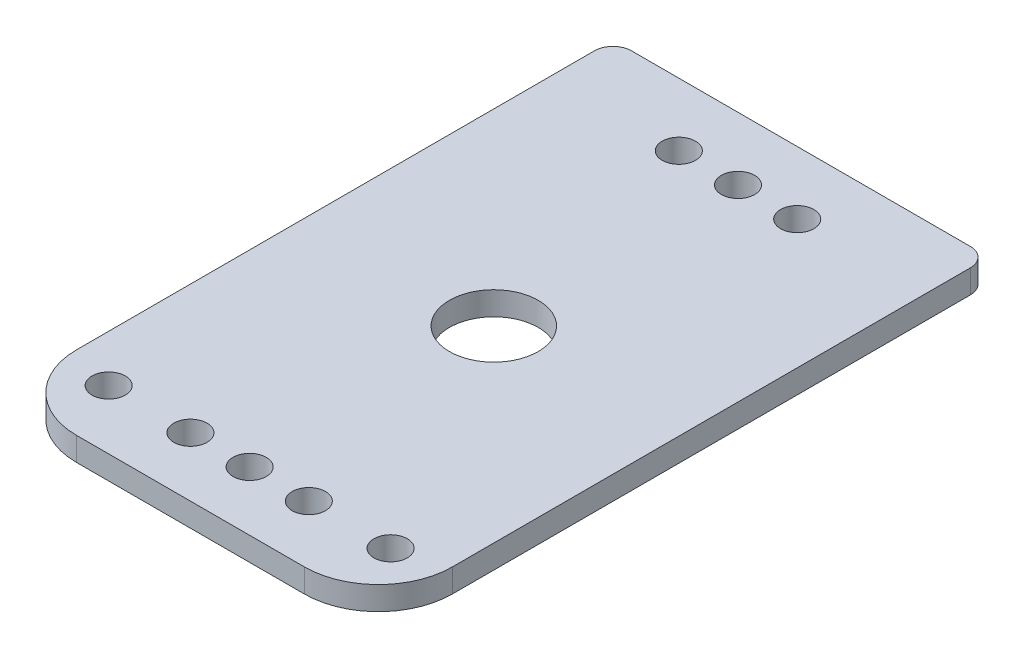
ISO-10303-21;
HEADER;
FILE_DESCRIPTION(('STEP AP214'),'2;1');
FILE_NAME('part.step','',(''),(''),'','','');
FILE_SCHEMA(('AUTOMOTIVE_DESIGN { 1 0 10303 214 1 1 1 1 }'));
ENDSEC;
DATA;
#1=APPLICATION_CONTEXT('core data for automotive mechanical design processes');
#2=APPLICATION_PROTOCOL_DEFINITION('international standard','automotive_design',2000,#1);
#3=PRODUCT_CONTEXT('',#1,'mechanical');
#4=PRODUCT('Part','Part','',(#3));
#5=PRODUCT_RELATED_PRODUCT_CATEGORY('part','',(#4));
#6=PRODUCT_DEFINITION_FORMATION('','',#4);
#7=PRODUCT_DEFINITION_CONTEXT('part definition',#1,'design');
#8=PRODUCT_DEFINITION('design','',#6,#7);
#9=PRODUCT_DEFINITION_SHAPE('','',#8);
#10=(LENGTH_UNIT() NAMED_UNIT(*) SI_UNIT(.MILLI.,.METRE.));
#11=(NAMED_UNIT(*) PLANE_ANGLE_UNIT() SI_UNIT($,.RADIAN.));
#12=(NAMED_UNIT(*) SI_UNIT($,.STERADIAN.) SOLID_ANGLE_UNIT());
#13=UNCERTAINTY_MEASURE_WITH_UNIT(LENGTH_MEASURE(1.E-05),#10,'distance_accuracy_value','');
#14=(GEOMETRIC_REPRESENTATION_CONTEXT(3) GLOBAL_UNCERTAINTY_ASSIGNED_CONTEXT((#13)) GLOBAL_UNIT_ASSIGNED_CONTEXT((#10,
#11,#12)) REPRESENTATION_CONTEXT('',''));
#15=CARTESIAN_POINT('',(0.,0.,0.));
#16=DIRECTION('',(0.,0.,1.));
#17=DIRECTION('',(1.,0.,0.));
#18=AXIS2_PLACEMENT_3D('',#15,#16,#17);
#19=CARTESIAN_POINT('',(22.9,121.175,-39.));
#20=DIRECTION('',(0.,1.,0.));
#21=DIRECTION('',(0.,0.,1.));
#22=AXIS2_PLACEMENT_3D('',#19,#20,#21);
#23=PLANE('',#22);
#24=CARTESIAN_POINT('',(8.,121.175,33.));
#25=DIRECTION('',(0.,1.,0.));
#26=DIRECTION('',(0.,0.,1.));
#27=AXIS2_PLACEMENT_3D('',#24,#25,#26);
#28=CIRCLE('',#27,2.25000000000021);
#29=CARTESIAN_POINT('',(8.,121.175,35.2500000000002));
#30=VERTEX_POINT('',#29);
#31=EDGE_CURVE('E224',#30,#30,#28,.T.);
#32=ORIENTED_EDGE('',*,*,#31,.F.);
#33=EDGE_LOOP('',(#32));
#34=FACE_BOUND('',#33,.T.);
#35=CARTESIAN_POINT('',(-7.99999999999975,121.175,33.));
#36=DIRECTION('',(0.,1.,0.));
#37=DIRECTION('',(0.,0.,1.));
#38=AXIS2_PLACEMENT_3D('',#35,#36,#37);
#39=CIRCLE('',#38,2.25);
#40=CARTESIAN_POINT('',(-7.99999999999975,121.175,35.25));
#41=VERTEX_POINT('',#40);
#42=EDGE_CURVE('E212',#41,#41,#39,.T.);
#43=ORIENTED_EDGE('',*,*,#42,.F.);
#44=EDGE_LOOP('',(#43));
#45=FACE_BOUND('',#44,.T.);
#46=CARTESIAN_POINT('',(-8.,121.175,-33.));
#47=DIRECTION('',(0.,1.,0.));
#48=DIRECTION('',(0.,0.,1.));
#49=AXIS2_PLACEMENT_3D('',#46,#47,#48);
#50=CIRCLE('',#49,2.25);
#51=CARTESIAN_POINT('',(-8.,121.175,-30.75));
#52=VERTEX_POINT('',#51);
#53=EDGE_CURVE('E200',#52,#52,#50,.T.);
#54=ORIENTED_EDGE('',*,*,#53,.F.);
#55=EDGE_LOOP('',(#54));
#56=FACE_BOUND('',#55,.T.);
#57=CARTESIAN_POINT('',(8.,121.175,-33.));
#58=DIRECTION('',(0.,1.,0.));
#59=DIRECTION('',(0.,0.,1.));
#60=AXIS2_PLACEMENT_3D('',#57,#58,#59);
#61=CIRCLE('',#60,2.25);
#62=CARTESIAN_POINT('',(8.,121.175,-30.75));
#63=VERTEX_POINT('',#62);
#64=EDGE_CURVE('E188',#63,#63,#61,.T.);
#65=ORIENTED_EDGE('',*,*,#64,.F.);
#66=EDGE_LOOP('',(#65));
#67=FACE_BOUND('',#66,.T.);
#68=CARTESIAN_POINT('',(22.9,121.175,-39.));
#69=DIRECTION('',(0.,1.,0.));
#70=DIRECTION('',(0.,0.,1.));
#71=AXIS2_PLACEMENT_3D('',#68,#69,#70);
#72=CIRCLE('',#71,2.5);
#73=CARTESIAN_POINT('',(25.4,121.175,-39.));
#74=VERTEX_POINT('',#73);
#75=CARTESIAN_POINT('',(22.9,121.175,-41.5));
#76=VERTEX_POINT('',#75);
#77=EDGE_CURVE('E151',#74,#76,#72,.T.);
#78=ORIENTED_EDGE('',*,*,#77,.T.);
#79=DIRECTION('',(-1.,0.,0.));
#80=VECTOR('',#79,1.);
#81=CARTESIAN_POINT('',(-22.9,121.175,-41.5));
#82=LINE('',#81,#80);
#83=CARTESIAN_POINT('',(-22.9,121.175,-41.5));
#84=VERTEX_POINT('',#83);
#85=EDGE_CURVE('E99',#76,#84,#82,.T.);
#86=ORIENTED_EDGE('',*,*,#85,.T.);
#87=CARTESIAN_POINT('',(-22.9,121.175,-39.));
#88=DIRECTION('',(0.,1.,0.));
#89=DIRECTION('',(0.,0.,1.));
#90=AXIS2_PLACEMENT_3D('',#87,#88,#89);
#91=CIRCLE('',#90,2.5);
#92=CARTESIAN_POINT('',(-25.4,121.175,-39.));
#93=VERTEX_POINT('',#92);
#94=EDGE_CURVE('E166',#84,#93,#91,.T.);
#95=ORIENTED_EDGE('',*,*,#94,.T.);
#96=DIRECTION('',(0.,0.,1.));
#97=VECTOR('',#96,1.);
#98=CARTESIAN_POINT('',(-25.4,121.175,-39.));
#99=LINE('',#98,#97);
#100=CARTESIAN_POINT('',(-25.4,121.175,30.9999999999999));
#101=VERTEX_POINT('',#100);
#102=EDGE_CURVE('E179',#93,#101,#99,.T.);
#103=ORIENTED_EDGE('',*,*,#102,.T.);
#104=CARTESIAN_POINT('',(-15.4,121.175,31.));
#105=DIRECTION('',(0.,1.,0.));
#106=DIRECTION('',(0.,0.,1.));
#107=AXIS2_PLACEMENT_3D('',#104,#105,#106);
#108=CIRCLE('',#107,10.);
#109=CARTESIAN_POINT('',(-15.3999999999999,121.175,41.));
#110=VERTEX_POINT('',#109);
#111=EDGE_CURVE('E118',#101,#110,#108,.T.);
#112=ORIENTED_EDGE('',*,*,#111,.T.);
#113=DIRECTION('',(1.,0.,0.));
#114=VECTOR('',#113,1.);
#115=CARTESIAN_POINT('',(-15.3999999999999,121.175,41.));
#116=LINE('',#115,#114);
#117=CARTESIAN_POINT('',(15.3999999999995,121.175,41.));
#118=VERTEX_POINT('',#117);
#119=EDGE_CURVE('E112',#110,#118,#116,.T.);
#120=ORIENTED_EDGE('',*,*,#119,.T.);
#121=CARTESIAN_POINT('',(15.4,121.175,31.));
#122=DIRECTION('',(0.,1.,0.));
#123=DIRECTION('',(0.,0.,1.));
#124=AXIS2_PLACEMENT_3D('',#121,#122,#123);
#125=CIRCLE('',#124,9.99999999999995);
#126=CARTESIAN_POINT('',(25.3999999999999,121.175,31.));
#127=VERTEX_POINT('',#126);
#128=EDGE_CURVE('E116',#118,#127,#125,.T.);
#129=ORIENTED_EDGE('',*,*,#128,.T.);
#130=DIRECTION('',(0.,0.,-1.));
#131=VECTOR('',#130,1.);
#132=CARTESIAN_POINT('',(25.4,121.175,-39.));
#133=LINE('',#132,#131);
#134=EDGE_CURVE('E56',#127,#74,#133,.T.);
#135=ORIENTED_EDGE('',*,*,#134,.T.);
#136=EDGE_LOOP('',(#78,#86,#95,#103,#112,#120,#129,#135));
#137=FACE_BOUND('',#136,.T.);
#138=CARTESIAN_POINT('',(0.,121.175,0.));
#139=DIRECTION('',(0.,1.,0.));
#140=DIRECTION('',(0.,0.,1.));
#141=AXIS2_PLACEMENT_3D('',#138,#139,#140);
#142=CIRCLE('',#141,5.99999999999999);
#143=CARTESIAN_POINT('',(0.,121.175,5.99999999999999));
#144=VERTEX_POINT('',#143);
#145=EDGE_CURVE('E140',#144,#144,#142,.T.);
#146=ORIENTED_EDGE('',*,*,#145,.F.);
#147=EDGE_LOOP('',(#146));
#148=FACE_BOUND('',#147,.T.);
#149=CARTESIAN_POINT('',(0.,121.175,-33.));
#150=DIRECTION('',(0.,1.,0.));
#151=DIRECTION('',(0.,0.,1.));
#152=AXIS2_PLACEMENT_3D('',#149,#150,#151);
#153=CIRCLE('',#152,2.25000000000001);
#154=CARTESIAN_POINT('',(0.,121.175,-30.75));
#155=VERTEX_POINT('',#154);
#156=EDGE_CURVE('E194',#155,#155,#153,.T.);
#157=ORIENTED_EDGE('',*,*,#156,.F.);
#158=EDGE_LOOP('',(#157));
#159=FACE_BOUND('',#158,.T.);
#160=CARTESIAN_POINT('',(-19.05,121.175,33.));
#161=DIRECTION('',(0.,1.,0.));
#162=DIRECTION('',(0.,0.,1.));
#163=AXIS2_PLACEMENT_3D('',#160,#161,#162);
#164=CIRCLE('',#163,2.25);
#165=CARTESIAN_POINT('',(-19.05,121.175,35.25));
#166=VERTEX_POINT('',#165);
#167=EDGE_CURVE('E206',#166,#166,#164,.T.);
#168=ORIENTED_EDGE('',*,*,#167,.F.);
#169=EDGE_LOOP('',(#168));
#170=FACE_BOUND('',#169,.T.);
#171=CARTESIAN_POINT('',(2.26396433926461E-13,121.175,33.));
#172=DIRECTION('',(0.,1.,0.));
#173=DIRECTION('',(0.,0.,1.));
#174=AXIS2_PLACEMENT_3D('',#171,#172,#173);
#175=CIRCLE('',#174,2.25);
#176=CARTESIAN_POINT('',(2.26396433926461E-13,121.175,35.25));
#177=VERTEX_POINT('',#176);
#178=EDGE_CURVE('E218',#177,#177,#175,.T.);
#179=ORIENTED_EDGE('',*,*,#178,.F.);
#180=EDGE_LOOP('',(#179));
#181=FACE_BOUND('',#180,.T.);
#182=CARTESIAN_POINT('',(19.05,121.175,33.));
#183=DIRECTION('',(0.,1.,0.));
#184=DIRECTION('',(0.,0.,1.));
#185=AXIS2_PLACEMENT_3D('',#182,#183,#184);
#186=CIRCLE('',#185,2.25000000000001);
#187=CARTESIAN_POINT('',(19.05,121.175,35.25));
#188=VERTEX_POINT('',#187);
#189=EDGE_CURVE('E230',#188,#188,#186,.T.);
#190=ORIENTED_EDGE('',*,*,#189,.F.);
#191=EDGE_LOOP('',(#190));
#192=FACE_BOUND('',#191,.T.);
#193=ADVANCED_FACE('F39',(#34,#45,#56,#67,#137,#148,#159,#170,#181,#192),#23,.T.);
#194=CARTESIAN_POINT('',(22.9,118.,-39.));
#195=DIRECTION('',(0.,1.,0.));
#196=DIRECTION('',(0.,0.,1.));
#197=AXIS2_PLACEMENT_3D('',#194,#195,#196);
#198=PLANE('',#197);
#199=CARTESIAN_POINT('',(22.9,118.,-39.));
#200=DIRECTION('',(0.,1.,0.));
#201=DIRECTION('',(0.,0.,1.));
#202=AXIS2_PLACEMENT_3D('',#199,#200,#201);
#203=CIRCLE('',#202,2.5);
#204=CARTESIAN_POINT('',(25.4,118.,-39.));
#205=VERTEX_POINT('',#204);
#206=CARTESIAN_POINT('',(22.9,118.,-41.5));
#207=VERTEX_POINT('',#206);
#208=EDGE_CURVE('E136',#205,#207,#203,.T.);
#209=ORIENTED_EDGE('',*,*,#208,.F.);
#210=DIRECTION('',(0.,0.,-1.));
#211=VECTOR('',#210,1.);
#212=CARTESIAN_POINT('',(25.4,118.,-39.));
#213=LINE('',#212,#211);
#214=CARTESIAN_POINT('',(25.3999999999999,118.,31.));
#215=VERTEX_POINT('',#214);
#216=EDGE_CURVE('E91',#215,#205,#213,.T.);
#217=ORIENTED_EDGE('',*,*,#216,.F.);
#218=CARTESIAN_POINT('',(15.4,118.,31.));
#219=DIRECTION('',(0.,1.,0.));
#220=DIRECTION('',(0.,0.,1.));
#221=AXIS2_PLACEMENT_3D('',#218,#219,#220);
#222=CIRCLE('',#221,9.99999999999995);
#223=CARTESIAN_POINT('',(15.3999999999995,118.,41.));
#224=VERTEX_POINT('',#223);
#225=EDGE_CURVE('E85',#224,#215,#222,.T.);
#226=ORIENTED_EDGE('',*,*,#225,.F.);
#227=DIRECTION('',(1.,0.,0.));
#228=VECTOR('',#227,1.);
#229=CARTESIAN_POINT('',(-15.3999999999999,118.,41.));
#230=LINE('',#229,#228);
#231=CARTESIAN_POINT('',(-15.3999999999999,118.,41.));
#232=VERTEX_POINT('',#231);
#233=EDGE_CURVE('E126',#232,#224,#230,.T.);
#234=ORIENTED_EDGE('',*,*,#233,.F.);
#235=CARTESIAN_POINT('',(-15.4,118.,31.));
#236=DIRECTION('',(0.,1.,0.));
#237=DIRECTION('',(0.,0.,1.));
#238=AXIS2_PLACEMENT_3D('',#235,#236,#237);
#239=CIRCLE('',#238,10.);
#240=CARTESIAN_POINT('',(-25.4,118.,30.9999999999999));
#241=VERTEX_POINT('',#240);
#242=EDGE_CURVE('E146',#241,#232,#239,.T.);
#243=ORIENTED_EDGE('',*,*,#242,.F.);
#244=DIRECTION('',(0.,0.,1.));
#245=VECTOR('',#244,1.);
#246=CARTESIAN_POINT('',(-25.4,118.,-39.));
#247=LINE('',#246,#245);
#248=CARTESIAN_POINT('',(-25.4,118.,-39.));
#249=VERTEX_POINT('',#248);
#250=EDGE_CURVE('E144',#249,#241,#247,.T.);
#251=ORIENTED_EDGE('',*,*,#250,.F.);
#252=CARTESIAN_POINT('',(-22.9,118.,-39.));
#253=DIRECTION('',(0.,1.,0.));
#254=DIRECTION('',(0.,0.,1.));
#255=AXIS2_PLACEMENT_3D('',#252,#253,#254);
#256=CIRCLE('',#255,2.5);
#257=CARTESIAN_POINT('',(-22.9,118.,-41.5));
#258=VERTEX_POINT('',#257);
#259=EDGE_CURVE('E142',#258,#249,#256,.T.);
#260=ORIENTED_EDGE('',*,*,#259,.F.);
#261=DIRECTION('',(-1.,0.,0.));
#262=VECTOR('',#261,1.);
#263=CARTESIAN_POINT('',(-22.9,118.,-41.5));
#264=LINE('',#263,#262);
#265=EDGE_CURVE('E139',#207,#258,#264,.T.);
#266=ORIENTED_EDGE('',*,*,#265,.F.);
#267=EDGE_LOOP('',(#209,#217,#226,#234,#243,#251,#260,#266));
#268=FACE_BOUND('',#267,.T.);
#269=CARTESIAN_POINT('',(0.,118.,0.));
#270=DIRECTION('',(0.,1.,0.));
#271=DIRECTION('',(0.,0.,1.));
#272=AXIS2_PLACEMENT_3D('',#269,#270,#271);
#273=CIRCLE('',#272,5.99999999999999);
#274=CARTESIAN_POINT('',(0.,118.,5.99999999999999));
#275=VERTEX_POINT('',#274);
#276=EDGE_CURVE('E185',#275,#275,#273,.T.);
#277=ORIENTED_EDGE('',*,*,#276,.T.);
#278=EDGE_LOOP('',(#277));
#279=FACE_BOUND('',#278,.T.);
#280=CARTESIAN_POINT('',(8.,118.,-33.));
#281=DIRECTION('',(0.,1.,0.));
#282=DIRECTION('',(0.,0.,1.));
#283=AXIS2_PLACEMENT_3D('',#280,#281,#282);
#284=CIRCLE('',#283,2.25);
#285=CARTESIAN_POINT('',(8.,118.,-30.75));
#286=VERTEX_POINT('',#285);
#287=EDGE_CURVE('E191',#286,#286,#284,.T.);
#288=ORIENTED_EDGE('',*,*,#287,.T.);
#289=EDGE_LOOP('',(#288));
#290=FACE_BOUND('',#289,.T.);
#291=CARTESIAN_POINT('',(0.,118.,-33.));
#292=DIRECTION('',(0.,1.,0.));
#293=DIRECTION('',(0.,0.,1.));
#294=AXIS2_PLACEMENT_3D('',#291,#292,#293);
#295=CIRCLE('',#294,2.25000000000001);
#296=CARTESIAN_POINT('',(0.,118.,-30.75));
#297=VERTEX_POINT('',#296);
#298=EDGE_CURVE('E197',#297,#297,#295,.T.);
#299=ORIENTED_EDGE('',*,*,#298,.T.);
#300=EDGE_LOOP('',(#299));
#301=FACE_BOUND('',#300,.T.);
#302=CARTESIAN_POINT('',(-8.,118.,-33.));
#303=DIRECTION('',(0.,1.,0.));
#304=DIRECTION('',(0.,0.,1.));
#305=AXIS2_PLACEMENT_3D('',#302,#303,#304);
#306=CIRCLE('',#305,2.25);
#307=CARTESIAN_POINT('',(-8.,118.,-30.75));
#308=VERTEX_POINT('',#307);
#309=EDGE_CURVE('E203',#308,#308,#306,.T.);
#310=ORIENTED_EDGE('',*,*,#309,.T.);
#311=EDGE_LOOP('',(#310));
#312=FACE_BOUND('',#311,.T.);
#313=CARTESIAN_POINT('',(-19.05,118.,33.));
#314=DIRECTION('',(0.,1.,0.));
#315=DIRECTION('',(0.,0.,1.));
#316=AXIS2_PLACEMENT_3D('',#313,#314,#315);
#317=CIRCLE('',#316,2.25);
#318=CARTESIAN_POINT('',(-19.05,118.,35.25));
#319=VERTEX_POINT('',#318);
#320=EDGE_CURVE('E209',#319,#319,#317,.T.);
#321=ORIENTED_EDGE('',*,*,#320,.T.);
#322=EDGE_LOOP('',(#321));
#323=FACE_BOUND('',#322,.T.);
#324=CARTESIAN_POINT('',(-7.99999999999975,118.,33.));
#325=DIRECTION('',(0.,1.,0.));
#326=DIRECTION('',(0.,0.,1.));
#327=AXIS2_PLACEMENT_3D('',#324,#325,#326);
#328=CIRCLE('',#327,2.25);
#329=CARTESIAN_POINT('',(-7.99999999999975,118.,35.25));
#330=VERTEX_POINT('',#329);
#331=EDGE_CURVE('E215',#330,#330,#328,.T.);
#332=ORIENTED_EDGE('',*,*,#331,.T.);
#333=EDGE_LOOP('',(#332));
#334=FACE_BOUND('',#333,.T.);
#335=CARTESIAN_POINT('',(2.26396433926461E-13,118.,33.));
#336=DIRECTION('',(0.,1.,0.));
#337=DIRECTION('',(0.,0.,1.));
#338=AXIS2_PLACEMENT_3D('',#335,#336,#337);
#339=CIRCLE('',#338,2.25);
#340=CARTESIAN_POINT('',(2.26396433926461E-13,118.,35.25));
#341=VERTEX_POINT('',#340);
#342=EDGE_CURVE('E221',#341,#341,#339,.T.);
#343=ORIENTED_EDGE('',*,*,#342,.T.);
#344=EDGE_LOOP('',(#343));
#345=FACE_BOUND('',#344,.T.);
#346=CARTESIAN_POINT('',(8.,118.,33.));
#347=DIRECTION('',(0.,1.,0.));
#348=DIRECTION('',(0.,0.,1.));
#349=AXIS2_PLACEMENT_3D('',#346,#347,#348);
#350=CIRCLE('',#349,2.25000000000021);
#351=CARTESIAN_POINT('',(8.,118.,35.2500000000002));
#352=VERTEX_POINT('',#351);
#353=EDGE_CURVE('E227',#352,#352,#350,.T.);
#354=ORIENTED_EDGE('',*,*,#353,.T.);
#355=EDGE_LOOP('',(#354));
#356=FACE_BOUND('',#355,.T.);
#357=CARTESIAN_POINT('',(19.05,118.,33.));
#358=DIRECTION('',(0.,1.,0.));
#359=DIRECTION('',(0.,0.,1.));
#360=AXIS2_PLACEMENT_3D('',#357,#358,#359);
#361=CIRCLE('',#360,2.25000000000001);
#362=CARTESIAN_POINT('',(19.05,118.,35.25));
#363=VERTEX_POINT('',#362);
#364=EDGE_CURVE('E233',#363,#363,#361,.T.);
#365=ORIENTED_EDGE('',*,*,#364,.T.);
#366=EDGE_LOOP('',(#365));
#367=FACE_BOUND('',#366,.T.);
#368=ADVANCED_FACE('F170',(#268,#279,#290,#301,#312,#323,#334,#345,#356,#367),#198,.F.);
#369=CARTESIAN_POINT('',(22.9,121.175,-39.));
#370=DIRECTION('',(0.,-1.,0.));
#371=DIRECTION('',(0.,0.,-1.));
#372=AXIS2_PLACEMENT_3D('',#369,#370,#371);
#373=CYLINDRICAL_SURFACE('',#372,2.5);
#374=ORIENTED_EDGE('',*,*,#208,.T.);
#375=DIRECTION('',(0.,-1.,0.));
#376=VECTOR('',#375,1.);
#377=CARTESIAN_POINT('',(22.9,121.175,-41.5));
#378=LINE('',#377,#376);
#379=EDGE_CURVE('E11',#76,#207,#378,.T.);
#380=ORIENTED_EDGE('',*,*,#379,.F.);
#381=ORIENTED_EDGE('',*,*,#77,.F.);
#382=DIRECTION('',(0.,-1.,0.));
#383=VECTOR('',#382,1.);
#384=CARTESIAN_POINT('',(25.4,121.175,-39.));
#385=LINE('',#384,#383);
#386=EDGE_CURVE('E132',#74,#205,#385,.T.);
#387=ORIENTED_EDGE('',*,*,#386,.T.);
#388=EDGE_LOOP('',(#374,#380,#381,#387));
#389=FACE_BOUND('',#388,.T.);
#390=ADVANCED_FACE('F41',(#389),#373,.T.);
#391=CARTESIAN_POINT('',(-22.9,121.175,-41.5));
#392=DIRECTION('',(0.,0.,1.));
#393=DIRECTION('',(1.,0.,0.));
#394=AXIS2_PLACEMENT_3D('',#391,#392,#393);
#395=PLANE('',#394);
#396=ORIENTED_EDGE('',*,*,#265,.T.);
#397=DIRECTION('',(0.,-1.,0.));
#398=VECTOR('',#397,1.);
#399=CARTESIAN_POINT('',(-22.9,121.175,-41.5));
#400=LINE('',#399,#398);
#401=EDGE_CURVE('E48',#84,#258,#400,.T.);
#402=ORIENTED_EDGE('',*,*,#401,.F.);
#403=ORIENTED_EDGE('',*,*,#85,.F.);
#404=ORIENTED_EDGE('',*,*,#379,.T.);
#405=EDGE_LOOP('',(#396,#402,#403,#404));
#406=FACE_BOUND('',#405,.T.);
#407=ADVANCED_FACE('F267',(#406),#395,.F.);
#408=CARTESIAN_POINT('',(-22.9,121.175,-39.));
#409=DIRECTION('',(0.,-1.,0.));
#410=DIRECTION('',(0.,0.,-1.));
#411=AXIS2_PLACEMENT_3D('',#408,#409,#410);
#412=CYLINDRICAL_SURFACE('',#411,2.5);
#413=ORIENTED_EDGE('',*,*,#259,.T.);
#414=DIRECTION('',(0.,-1.,0.));
#415=VECTOR('',#414,1.);
#416=CARTESIAN_POINT('',(-25.4,121.175,-39.));
#417=LINE('',#416,#415);
#418=EDGE_CURVE('E158',#93,#249,#417,.T.);
#419=ORIENTED_EDGE('',*,*,#418,.F.);
#420=ORIENTED_EDGE('',*,*,#94,.F.);
#421=ORIENTED_EDGE('',*,*,#401,.T.);
#422=EDGE_LOOP('',(#413,#419,#420,#421));
#423=FACE_BOUND('',#422,.T.);
#424=ADVANCED_FACE('F164',(#423),#412,.T.);
#425=CARTESIAN_POINT('',(-25.4,121.175,-39.));
#426=DIRECTION('',(1.,0.,0.));
#427=DIRECTION('',(0.,0.,-1.));
#428=AXIS2_PLACEMENT_3D('',#425,#426,#427);
#429=PLANE('',#428);
#430=ORIENTED_EDGE('',*,*,#250,.T.);
#431=DIRECTION('',(0.,-1.,0.));
#432=VECTOR('',#431,1.);
#433=CARTESIAN_POINT('',(-25.4,121.175,30.9999999999999));
#434=LINE('',#433,#432);
#435=EDGE_CURVE('E155',#101,#241,#434,.T.);
#436=ORIENTED_EDGE('',*,*,#435,.F.);
#437=ORIENTED_EDGE('',*,*,#102,.F.);
#438=ORIENTED_EDGE('',*,*,#418,.T.);
#439=EDGE_LOOP('',(#430,#436,#437,#438));
#440=FACE_BOUND('',#439,.T.);
#441=ADVANCED_FACE('F175',(#440),#429,.F.);
#442=CARTESIAN_POINT('',(-15.4,121.175,31.));
#443=DIRECTION('',(0.,-1.,0.));
#444=DIRECTION('',(0.,0.,-1.));
#445=AXIS2_PLACEMENT_3D('',#442,#443,#444);
#446=CYLINDRICAL_SURFACE('',#445,10.);
#447=ORIENTED_EDGE('',*,*,#242,.T.);
#448=DIRECTION('',(0.,-1.,0.));
#449=VECTOR('',#448,1.);
#450=CARTESIAN_POINT('',(-15.3999999999999,121.175,41.));
#451=LINE('',#450,#449);
#452=EDGE_CURVE('E127',#110,#232,#451,.T.);
#453=ORIENTED_EDGE('',*,*,#452,.F.);
#454=ORIENTED_EDGE('',*,*,#111,.F.);
#455=ORIENTED_EDGE('',*,*,#435,.T.);
#456=EDGE_LOOP('',(#447,#453,#454,#455));
#457=FACE_BOUND('',#456,.T.);
#458=ADVANCED_FACE('F178',(#457),#446,.T.);
#459=CARTESIAN_POINT('',(-15.3999999999999,121.175,41.));
#460=DIRECTION('',(0.,0.,-1.));
#461=DIRECTION('',(-1.,0.,0.));
#462=AXIS2_PLACEMENT_3D('',#459,#460,#461);
#463=PLANE('',#462);
#464=ORIENTED_EDGE('',*,*,#233,.T.);
#465=DIRECTION('',(0.,-1.,0.));
#466=VECTOR('',#465,1.);
#467=CARTESIAN_POINT('',(15.3999999999995,121.175,41.));
#468=LINE('',#467,#466);
#469=EDGE_CURVE('E123',#118,#224,#468,.T.);
#470=ORIENTED_EDGE('',*,*,#469,.F.);
#471=ORIENTED_EDGE('',*,*,#119,.F.);
#472=ORIENTED_EDGE('',*,*,#452,.T.);
#473=EDGE_LOOP('',(#464,#470,#471,#472));
#474=FACE_BOUND('',#473,.T.);
#475=ADVANCED_FACE('F124',(#474),#463,.F.);
#476=CARTESIAN_POINT('',(15.4,121.175,31.));
#477=DIRECTION('',(0.,-1.,0.));
#478=DIRECTION('',(0.,0.,-1.));
#479=AXIS2_PLACEMENT_3D('',#476,#477,#478);
#480=CYLINDRICAL_SURFACE('',#479,9.99999999999995);
#481=ORIENTED_EDGE('',*,*,#225,.T.);
#482=DIRECTION('',(0.,-1.,0.));
#483=VECTOR('',#482,1.);
#484=CARTESIAN_POINT('',(25.3999999999999,121.175,31.));
#485=LINE('',#484,#483);
#486=EDGE_CURVE('E128',#127,#215,#485,.T.);
#487=ORIENTED_EDGE('',*,*,#486,.F.);
#488=ORIENTED_EDGE('',*,*,#128,.F.);
#489=ORIENTED_EDGE('',*,*,#469,.T.);
#490=EDGE_LOOP('',(#481,#487,#488,#489));
#491=FACE_BOUND('',#490,.T.);
#492=ADVANCED_FACE('F130',(#491),#480,.T.);
#493=CARTESIAN_POINT('',(25.4,121.175,-39.));
#494=DIRECTION('',(-1.,0.,0.));
#495=DIRECTION('',(0.,0.,1.));
#496=AXIS2_PLACEMENT_3D('',#493,#494,#495);
#497=PLANE('',#496);
#498=ORIENTED_EDGE('',*,*,#216,.T.);
#499=ORIENTED_EDGE('',*,*,#386,.F.);
#500=ORIENTED_EDGE('',*,*,#134,.F.);
#501=ORIENTED_EDGE('',*,*,#486,.T.);
#502=EDGE_LOOP('',(#498,#499,#500,#501));
#503=FACE_BOUND('',#502,.T.);
#504=ADVANCED_FACE('F255',(#503),#497,.F.);
#505=CARTESIAN_POINT('',(0.,121.175,0.));
#506=DIRECTION('',(0.,-1.,0.));
#507=DIRECTION('',(0.,0.,-1.));
#508=AXIS2_PLACEMENT_3D('',#505,#506,#507);
#509=CYLINDRICAL_SURFACE('',#508,5.99999999999999);
#510=ORIENTED_EDGE('',*,*,#145,.T.);
#511=EDGE_LOOP('',(#510));
#512=FACE_BOUND('',#511,.T.);
#513=ORIENTED_EDGE('',*,*,#276,.F.);
#514=EDGE_LOOP('',(#513));
#515=FACE_BOUND('',#514,.T.);
#516=ADVANCED_FACE('F252',(#512,#515),#509,.F.);
#517=CARTESIAN_POINT('',(8.,121.175,-33.));
#518=DIRECTION('',(0.,-1.,0.));
#519=DIRECTION('',(0.,0.,-1.));
#520=AXIS2_PLACEMENT_3D('',#517,#518,#519);
#521=CYLINDRICAL_SURFACE('',#520,2.25);
#522=ORIENTED_EDGE('',*,*,#64,.T.);
#523=EDGE_LOOP('',(#522));
#524=FACE_BOUND('',#523,.T.);
#525=ORIENTED_EDGE('',*,*,#287,.F.);
#526=EDGE_LOOP('',(#525));
#527=FACE_BOUND('',#526,.T.);
#528=ADVANCED_FACE('F330',(#524,#527),#521,.F.);
#529=CARTESIAN_POINT('',(0.,121.175,-33.));
#530=DIRECTION('',(0.,-1.,0.));
#531=DIRECTION('',(0.,0.,-1.));
#532=AXIS2_PLACEMENT_3D('',#529,#530,#531);
#533=CYLINDRICAL_SURFACE('',#532,2.25000000000001);
#534=ORIENTED_EDGE('',*,*,#156,.T.);
#535=EDGE_LOOP('',(#534));
#536=FACE_BOUND('',#535,.T.);
#537=ORIENTED_EDGE('',*,*,#298,.F.);
#538=EDGE_LOOP('',(#537));
#539=FACE_BOUND('',#538,.T.);
#540=ADVANCED_FACE('F338',(#536,#539),#533,.F.);
#541=CARTESIAN_POINT('',(-8.,121.175,-33.));
#542=DIRECTION('',(0.,-1.,0.));
#543=DIRECTION('',(0.,0.,-1.));
#544=AXIS2_PLACEMENT_3D('',#541,#542,#543);
#545=CYLINDRICAL_SURFACE('',#544,2.25);
#546=ORIENTED_EDGE('',*,*,#53,.T.);
#547=EDGE_LOOP('',(#546));
#548=FACE_BOUND('',#547,.T.);
#549=ORIENTED_EDGE('',*,*,#309,.F.);
#550=EDGE_LOOP('',(#549));
#551=FACE_BOUND('',#550,.T.);
#552=ADVANCED_FACE('F346',(#548,#551),#545,.F.);
#553=CARTESIAN_POINT('',(-19.05,121.175,33.));
#554=DIRECTION('',(0.,-1.,0.));
#555=DIRECTION('',(0.,0.,-1.));
#556=AXIS2_PLACEMENT_3D('',#553,#554,#555);
#557=CYLINDRICAL_SURFACE('',#556,2.25);
#558=ORIENTED_EDGE('',*,*,#167,.T.);
#559=EDGE_LOOP('',(#558));
#560=FACE_BOUND('',#559,.T.);
#561=ORIENTED_EDGE('',*,*,#320,.F.);
#562=EDGE_LOOP('',(#561));
#563=FACE_BOUND('',#562,.T.);
#564=ADVANCED_FACE('F355',(#560,#563),#557,.F.);
#565=CARTESIAN_POINT('',(-7.99999999999975,121.175,33.));
#566=DIRECTION('',(0.,-1.,0.));
#567=DIRECTION('',(0.,0.,-1.));
#568=AXIS2_PLACEMENT_3D('',#565,#566,#567);
#569=CYLINDRICAL_SURFACE('',#568,2.25);
#570=ORIENTED_EDGE('',*,*,#42,.T.);
#571=EDGE_LOOP('',(#570));
#572=FACE_BOUND('',#571,.T.);
#573=ORIENTED_EDGE('',*,*,#331,.F.);
#574=EDGE_LOOP('',(#573));
#575=FACE_BOUND('',#574,.T.);
#576=ADVANCED_FACE('F364',(#572,#575),#569,.F.);
#577=CARTESIAN_POINT('',(2.26396433926461E-13,121.175,33.));
#578=DIRECTION('',(0.,-1.,0.));
#579=DIRECTION('',(0.,0.,-1.));
#580=AXIS2_PLACEMENT_3D('',#577,#578,#579);
#581=CYLINDRICAL_SURFACE('',#580,2.25);
#582=ORIENTED_EDGE('',*,*,#178,.T.);
#583=EDGE_LOOP('',(#582));
#584=FACE_BOUND('',#583,.T.);
#585=ORIENTED_EDGE('',*,*,#342,.F.);
#586=EDGE_LOOP('',(#585));
#587=FACE_BOUND('',#586,.T.);
#588=ADVANCED_FACE('F373',(#584,#587),#581,.F.);
#589=CARTESIAN_POINT('',(8.,121.175,33.));
#590=DIRECTION('',(0.,-1.,0.));
#591=DIRECTION('',(0.,0.,-1.));
#592=AXIS2_PLACEMENT_3D('',#589,#590,#591);
#593=CYLINDRICAL_SURFACE('',#592,2.25000000000021);
#594=ORIENTED_EDGE('',*,*,#31,.T.);
#595=EDGE_LOOP('',(#594));
#596=FACE_BOUND('',#595,.T.);
#597=ORIENTED_EDGE('',*,*,#353,.F.);
#598=EDGE_LOOP('',(#597));
#599=FACE_BOUND('',#598,.T.);
#600=ADVANCED_FACE('F382',(#596,#599),#593,.F.);
#601=CARTESIAN_POINT('',(19.05,121.175,33.));
#602=DIRECTION('',(0.,-1.,0.));
#603=DIRECTION('',(0.,0.,-1.));
#604=AXIS2_PLACEMENT_3D('',#601,#602,#603);
#605=CYLINDRICAL_SURFACE('',#604,2.25000000000001);
#606=ORIENTED_EDGE('',*,*,#189,.T.);
#607=EDGE_LOOP('',(#606));
#608=FACE_BOUND('',#607,.T.);
#609=ORIENTED_EDGE('',*,*,#364,.F.);
#610=EDGE_LOOP('',(#609));
#611=FACE_BOUND('',#610,.T.);
#612=ADVANCED_FACE('F239',(#608,#611),#605,.F.);
#613=CLOSED_SHELL('',(#193,#368,#390,#407,#424,#441,#458,#475,#492,#504,#516,#528,#540,#552,
#564,#576,#588,#600,#612));
#614=MANIFOLD_SOLID_BREP('B2',#613);
#615=ADVANCED_BREP_SHAPE_REPRESENTATION('',(#18,#614),#14);
#616=SHAPE_DEFINITION_REPRESENTATION(#9,#615);
ENDSEC;
END-ISO-10303-21;
